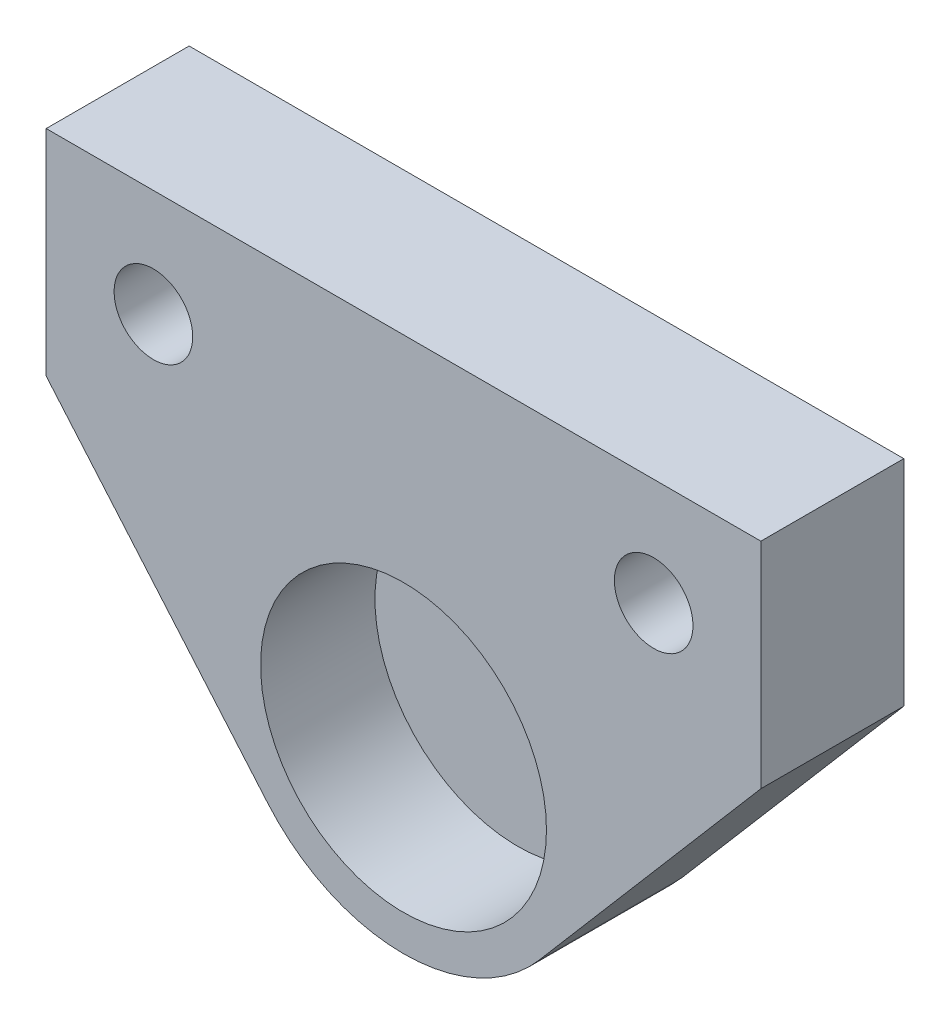
ISO-10303-21;
HEADER;
FILE_DESCRIPTION(('STEP AP214'),'2;1');
FILE_NAME('part.step','',(''),(''),'','','');
FILE_SCHEMA(('AUTOMOTIVE_DESIGN { 1 0 10303 214 1 1 1 1 }'));
ENDSEC;
DATA;
#1=APPLICATION_CONTEXT('core data for automotive mechanical design processes');
#2=APPLICATION_PROTOCOL_DEFINITION('international standard','automotive_design',2000,#1);
#3=PRODUCT_CONTEXT('',#1,'mechanical');
#4=PRODUCT('Part','Part','',(#3));
#5=PRODUCT_RELATED_PRODUCT_CATEGORY('part','',(#4));
#6=PRODUCT_DEFINITION_FORMATION('','',#4);
#7=PRODUCT_DEFINITION_CONTEXT('part definition',#1,'design');
#8=PRODUCT_DEFINITION('design','',#6,#7);
#9=PRODUCT_DEFINITION_SHAPE('','',#8);
#10=(LENGTH_UNIT() NAMED_UNIT(*) SI_UNIT(.MILLI.,.METRE.));
#11=(NAMED_UNIT(*) PLANE_ANGLE_UNIT() SI_UNIT($,.RADIAN.));
#12=(NAMED_UNIT(*) SI_UNIT($,.STERADIAN.) SOLID_ANGLE_UNIT());
#13=UNCERTAINTY_MEASURE_WITH_UNIT(LENGTH_MEASURE(1.E-05),#10,'distance_accuracy_value','');
#14=(GEOMETRIC_REPRESENTATION_CONTEXT(3) GLOBAL_UNCERTAINTY_ASSIGNED_CONTEXT((#13)) GLOBAL_UNIT_ASSIGNED_CONTEXT((#10,
#11,#12)) REPRESENTATION_CONTEXT('',''));
#15=CARTESIAN_POINT('',(0.,0.,0.));
#16=DIRECTION('',(0.,0.,1.));
#17=DIRECTION('',(1.,0.,0.));
#18=AXIS2_PLACEMENT_3D('',#15,#16,#17);
#19=CARTESIAN_POINT('',(0.,0.,0.));
#20=DIRECTION('',(0.,0.,1.));
#21=DIRECTION('',(1.,0.,0.));
#22=AXIS2_PLACEMENT_3D('',#19,#20,#21);
#23=PLANE('',#22);
#24=CARTESIAN_POINT('',(-17.5,17.4991007879726,0.));
#25=DIRECTION('',(0.,0.,-1.));
#26=DIRECTION('',(-1.,0.,0.));
#27=AXIS2_PLACEMENT_3D('',#24,#25,#26);
#28=CIRCLE('',#27,5.735);
#29=CARTESIAN_POINT('',(-23.235,17.4991007879726,0.));
#30=VERTEX_POINT('',#29);
#31=EDGE_CURVE('E201',#30,#30,#28,.T.);
#32=ORIENTED_EDGE('',*,*,#31,.F.);
#33=EDGE_LOOP('',(#32));
#34=FACE_BOUND('',#33,.T.);
#35=CARTESIAN_POINT('',(0.,0.,0.));
#36=DIRECTION('',(0.,0.,1.));
#37=DIRECTION('',(1.,0.,0.));
#38=AXIS2_PLACEMENT_3D('',#35,#36,#37);
#39=CIRCLE('',#38,12.5);
#40=CARTESIAN_POINT('',(-9.49973793714201,-8.12434484285502,0.));
#41=VERTEX_POINT('',#40);
#42=CARTESIAN_POINT('',(9.499737937142,-8.12434484285502,0.));
#43=VERTEX_POINT('',#42);
#44=EDGE_CURVE('E120',#41,#43,#39,.T.);
#45=ORIENTED_EDGE('',*,*,#44,.F.);
#46=DIRECTION('',(0.649947587428401,-0.759979034971361,0.));
#47=VECTOR('',#46,1.);
#48=CARTESIAN_POINT('',(-9.49973793714201,-8.12434484285502,0.));
#49=LINE('',#48,#47);
#50=CARTESIAN_POINT('',(-25.,10.,0.));
#51=VERTEX_POINT('',#50);
#52=EDGE_CURVE('E81',#51,#41,#49,.T.);
#53=ORIENTED_EDGE('',*,*,#52,.F.);
#54=DIRECTION('',(0.,-1.,0.));
#55=VECTOR('',#54,1.);
#56=CARTESIAN_POINT('',(-25.,10.,0.));
#57=LINE('',#56,#55);
#58=CARTESIAN_POINT('',(-25.,25.,0.));
#59=VERTEX_POINT('',#58);
#60=EDGE_CURVE('E75',#59,#51,#57,.T.);
#61=ORIENTED_EDGE('',*,*,#60,.F.);
#62=DIRECTION('',(-1.,0.,0.));
#63=VECTOR('',#62,1.);
#64=CARTESIAN_POINT('',(-25.,25.,0.));
#65=LINE('',#64,#63);
#66=CARTESIAN_POINT('',(25.,25.,0.));
#67=VERTEX_POINT('',#66);
#68=EDGE_CURVE('E110',#67,#59,#65,.T.);
#69=ORIENTED_EDGE('',*,*,#68,.F.);
#70=DIRECTION('',(0.,1.,0.));
#71=VECTOR('',#70,1.);
#72=CARTESIAN_POINT('',(25.,25.,0.));
#73=LINE('',#72,#71);
#74=CARTESIAN_POINT('',(25.,10.,0.));
#75=VERTEX_POINT('',#74);
#76=EDGE_CURVE('E126',#75,#67,#73,.T.);
#77=ORIENTED_EDGE('',*,*,#76,.F.);
#78=DIRECTION('',(0.649947587428401,0.759979034971361,0.));
#79=VECTOR('',#78,1.);
#80=CARTESIAN_POINT('',(25.,10.,0.));
#81=LINE('',#80,#79);
#82=EDGE_CURVE('E123',#43,#75,#81,.T.);
#83=ORIENTED_EDGE('',*,*,#82,.F.);
#84=EDGE_LOOP('',(#45,#53,#61,#69,#77,#83));
#85=FACE_BOUND('',#84,.T.);
#86=CARTESIAN_POINT('',(17.5,17.4991007879726,0.));
#87=DIRECTION('',(0.,0.,-1.));
#88=DIRECTION('',(-1.,0.,0.));
#89=AXIS2_PLACEMENT_3D('',#86,#87,#88);
#90=CIRCLE('',#89,5.735);
#91=CARTESIAN_POINT('',(11.765,17.4991007879726,0.));
#92=VERTEX_POINT('',#91);
#93=EDGE_CURVE('E194',#92,#92,#90,.T.);
#94=ORIENTED_EDGE('',*,*,#93,.F.);
#95=EDGE_LOOP('',(#94));
#96=FACE_BOUND('',#95,.T.);
#97=ADVANCED_FACE('F35',(#34,#85,#96),#23,.F.);
#98=CARTESIAN_POINT('',(0.,0.,10.));
#99=DIRECTION('',(0.,0.,-1.));
#100=DIRECTION('',(-1.,0.,0.));
#101=AXIS2_PLACEMENT_3D('',#98,#99,#100);
#102=CYLINDRICAL_SURFACE('',#101,12.5);
#103=ORIENTED_EDGE('',*,*,#44,.T.);
#104=DIRECTION('',(0.,0.,-1.));
#105=VECTOR('',#104,1.);
#106=CARTESIAN_POINT('',(9.499737937142,-8.12434484285502,10.));
#107=LINE('',#106,#105);
#108=CARTESIAN_POINT('',(9.499737937142,-8.12434484285502,10.));
#109=VERTEX_POINT('',#108);
#110=EDGE_CURVE('E11',#109,#43,#107,.T.);
#111=ORIENTED_EDGE('',*,*,#110,.F.);
#112=CARTESIAN_POINT('',(0.,0.,10.));
#113=DIRECTION('',(0.,0.,1.));
#114=DIRECTION('',(1.,0.,0.));
#115=AXIS2_PLACEMENT_3D('',#112,#113,#114);
#116=CIRCLE('',#115,12.5);
#117=CARTESIAN_POINT('',(-9.49973793714201,-8.12434484285502,10.));
#118=VERTEX_POINT('',#117);
#119=EDGE_CURVE('E131',#118,#109,#116,.T.);
#120=ORIENTED_EDGE('',*,*,#119,.F.);
#121=DIRECTION('',(0.,0.,-1.));
#122=VECTOR('',#121,1.);
#123=CARTESIAN_POINT('',(-9.49973793714201,-8.12434484285502,10.));
#124=LINE('',#123,#122);
#125=EDGE_CURVE('E116',#118,#41,#124,.T.);
#126=ORIENTED_EDGE('',*,*,#125,.T.);
#127=EDGE_LOOP('',(#103,#111,#120,#126));
#128=FACE_BOUND('',#127,.T.);
#129=ADVANCED_FACE('F37',(#128),#102,.T.);
#130=CARTESIAN_POINT('',(25.,10.,10.));
#131=DIRECTION('',(-0.759979034971361,0.649947587428401,0.));
#132=DIRECTION('',(-0.649947587428401,-0.759979034971361,0.));
#133=AXIS2_PLACEMENT_3D('',#130,#131,#132);
#134=PLANE('',#133);
#135=ORIENTED_EDGE('',*,*,#82,.T.);
#136=DIRECTION('',(0.,0.,-1.));
#137=VECTOR('',#136,1.);
#138=CARTESIAN_POINT('',(25.,10.,10.));
#139=LINE('',#138,#137);
#140=CARTESIAN_POINT('',(25.,10.,10.));
#141=VERTEX_POINT('',#140);
#142=EDGE_CURVE('E44',#141,#75,#139,.T.);
#143=ORIENTED_EDGE('',*,*,#142,.F.);
#144=DIRECTION('',(0.649947587428401,0.759979034971361,0.));
#145=VECTOR('',#144,1.);
#146=CARTESIAN_POINT('',(25.,10.,10.));
#147=LINE('',#146,#145);
#148=EDGE_CURVE('E89',#109,#141,#147,.T.);
#149=ORIENTED_EDGE('',*,*,#148,.F.);
#150=ORIENTED_EDGE('',*,*,#110,.T.);
#151=EDGE_LOOP('',(#135,#143,#149,#150));
#152=FACE_BOUND('',#151,.T.);
#153=ADVANCED_FACE('F161',(#152),#134,.F.);
#154=CARTESIAN_POINT('',(25.,25.,10.));
#155=DIRECTION('',(-1.,0.,0.));
#156=DIRECTION('',(0.,-1.,0.));
#157=AXIS2_PLACEMENT_3D('',#154,#155,#156);
#158=PLANE('',#157);
#159=ORIENTED_EDGE('',*,*,#76,.T.);
#160=DIRECTION('',(0.,0.,-1.));
#161=VECTOR('',#160,1.);
#162=CARTESIAN_POINT('',(25.,25.,10.));
#163=LINE('',#162,#161);
#164=CARTESIAN_POINT('',(25.,25.,10.));
#165=VERTEX_POINT('',#164);
#166=EDGE_CURVE('E111',#165,#67,#163,.T.);
#167=ORIENTED_EDGE('',*,*,#166,.F.);
#168=DIRECTION('',(0.,1.,0.));
#169=VECTOR('',#168,1.);
#170=CARTESIAN_POINT('',(25.,25.,10.));
#171=LINE('',#170,#169);
#172=EDGE_CURVE('E102',#141,#165,#171,.T.);
#173=ORIENTED_EDGE('',*,*,#172,.F.);
#174=ORIENTED_EDGE('',*,*,#142,.T.);
#175=EDGE_LOOP('',(#159,#167,#173,#174));
#176=FACE_BOUND('',#175,.T.);
#177=ADVANCED_FACE('F137',(#176),#158,.F.);
#178=CARTESIAN_POINT('',(-25.,25.,10.));
#179=DIRECTION('',(0.,-1.,0.));
#180=DIRECTION('',(0.,0.,-1.));
#181=AXIS2_PLACEMENT_3D('',#178,#179,#180);
#182=PLANE('',#181);
#183=ORIENTED_EDGE('',*,*,#68,.T.);
#184=DIRECTION('',(0.,0.,-1.));
#185=VECTOR('',#184,1.);
#186=CARTESIAN_POINT('',(-25.,25.,10.));
#187=LINE('',#186,#185);
#188=CARTESIAN_POINT('',(-25.,25.,10.));
#189=VERTEX_POINT('',#188);
#190=EDGE_CURVE('E107',#189,#59,#187,.T.);
#191=ORIENTED_EDGE('',*,*,#190,.F.);
#192=DIRECTION('',(-1.,0.,0.));
#193=VECTOR('',#192,1.);
#194=CARTESIAN_POINT('',(-25.,25.,10.));
#195=LINE('',#194,#193);
#196=EDGE_CURVE('E96',#165,#189,#195,.T.);
#197=ORIENTED_EDGE('',*,*,#196,.F.);
#198=ORIENTED_EDGE('',*,*,#166,.T.);
#199=EDGE_LOOP('',(#183,#191,#197,#198));
#200=FACE_BOUND('',#199,.T.);
#201=ADVANCED_FACE('F108',(#200),#182,.F.);
#202=CARTESIAN_POINT('',(-25.,10.,10.));
#203=DIRECTION('',(1.,0.,0.));
#204=DIRECTION('',(0.,0.,-1.));
#205=AXIS2_PLACEMENT_3D('',#202,#203,#204);
#206=PLANE('',#205);
#207=ORIENTED_EDGE('',*,*,#60,.T.);
#208=DIRECTION('',(0.,0.,-1.));
#209=VECTOR('',#208,1.);
#210=CARTESIAN_POINT('',(-25.,10.,10.));
#211=LINE('',#210,#209);
#212=CARTESIAN_POINT('',(-25.,10.,10.));
#213=VERTEX_POINT('',#212);
#214=EDGE_CURVE('E112',#213,#51,#211,.T.);
#215=ORIENTED_EDGE('',*,*,#214,.F.);
#216=DIRECTION('',(0.,-1.,0.));
#217=VECTOR('',#216,1.);
#218=CARTESIAN_POINT('',(-25.,10.,10.));
#219=LINE('',#218,#217);
#220=EDGE_CURVE('E100',#189,#213,#219,.T.);
#221=ORIENTED_EDGE('',*,*,#220,.F.);
#222=ORIENTED_EDGE('',*,*,#190,.T.);
#223=EDGE_LOOP('',(#207,#215,#221,#222));
#224=FACE_BOUND('',#223,.T.);
#225=ADVANCED_FACE('F114',(#224),#206,.F.);
#226=CARTESIAN_POINT('',(-9.49973793714201,-8.12434484285502,10.));
#227=DIRECTION('',(0.759979034971361,0.649947587428401,0.));
#228=DIRECTION('',(-0.649947587428401,0.759979034971361,0.));
#229=AXIS2_PLACEMENT_3D('',#226,#227,#228);
#230=PLANE('',#229);
#231=ORIENTED_EDGE('',*,*,#52,.T.);
#232=ORIENTED_EDGE('',*,*,#125,.F.);
#233=DIRECTION('',(0.649947587428401,-0.759979034971361,0.));
#234=VECTOR('',#233,1.);
#235=CARTESIAN_POINT('',(-9.49973793714201,-8.12434484285502,10.));
#236=LINE('',#235,#234);
#237=EDGE_CURVE('E52',#213,#118,#236,.T.);
#238=ORIENTED_EDGE('',*,*,#237,.F.);
#239=ORIENTED_EDGE('',*,*,#214,.T.);
#240=EDGE_LOOP('',(#231,#232,#238,#239));
#241=FACE_BOUND('',#240,.T.);
#242=ADVANCED_FACE('F144',(#241),#230,.F.);
#243=CARTESIAN_POINT('',(0.,0.,10.));
#244=DIRECTION('',(0.,0.,1.));
#245=DIRECTION('',(1.,0.,0.));
#246=AXIS2_PLACEMENT_3D('',#243,#244,#245);
#247=PLANE('',#246);
#248=CARTESIAN_POINT('',(17.5,17.4991007879726,10.));
#249=DIRECTION('',(0.,0.,1.));
#250=DIRECTION('',(1.,0.,0.));
#251=AXIS2_PLACEMENT_3D('',#248,#249,#250);
#252=CIRCLE('',#251,2.75);
#253=CARTESIAN_POINT('',(20.25,17.4991007879726,10.));
#254=VERTEX_POINT('',#253);
#255=EDGE_CURVE('E196',#254,#254,#252,.T.);
#256=ORIENTED_EDGE('',*,*,#255,.F.);
#257=EDGE_LOOP('',(#256));
#258=FACE_BOUND('',#257,.T.);
#259=CARTESIAN_POINT('',(-17.5,17.4991007879726,10.));
#260=DIRECTION('',(0.,0.,1.));
#261=DIRECTION('',(1.,0.,0.));
#262=AXIS2_PLACEMENT_3D('',#259,#260,#261);
#263=CIRCLE('',#262,2.75);
#264=CARTESIAN_POINT('',(-14.75,17.4991007879726,10.));
#265=VERTEX_POINT('',#264);
#266=EDGE_CURVE('E207',#265,#265,#263,.T.);
#267=ORIENTED_EDGE('',*,*,#266,.F.);
#268=EDGE_LOOP('',(#267));
#269=FACE_BOUND('',#268,.T.);
#270=CARTESIAN_POINT('',(0.,0.,10.));
#271=DIRECTION('',(0.,0.,1.));
#272=DIRECTION('',(1.,0.,0.));
#273=AXIS2_PLACEMENT_3D('',#270,#271,#272);
#274=CIRCLE('',#273,10.);
#275=CARTESIAN_POINT('',(10.,0.,10.));
#276=VERTEX_POINT('',#275);
#277=EDGE_CURVE('E210',#276,#276,#274,.T.);
#278=ORIENTED_EDGE('',*,*,#277,.F.);
#279=EDGE_LOOP('',(#278));
#280=FACE_BOUND('',#279,.T.);
#281=ORIENTED_EDGE('',*,*,#119,.T.);
#282=ORIENTED_EDGE('',*,*,#148,.T.);
#283=ORIENTED_EDGE('',*,*,#172,.T.);
#284=ORIENTED_EDGE('',*,*,#196,.T.);
#285=ORIENTED_EDGE('',*,*,#220,.T.);
#286=ORIENTED_EDGE('',*,*,#237,.T.);
#287=EDGE_LOOP('',(#281,#282,#283,#284,#285,#286));
#288=FACE_BOUND('',#287,.T.);
#289=ADVANCED_FACE('F98',(#258,#269,#280,#288),#247,.T.);
#290=CARTESIAN_POINT('',(0.,0.,2.));
#291=DIRECTION('',(0.,0.,1.));
#292=DIRECTION('',(1.,0.,0.));
#293=AXIS2_PLACEMENT_3D('',#290,#291,#292);
#294=CYLINDRICAL_SURFACE('',#293,10.);
#295=CARTESIAN_POINT('',(0.,0.,2.));
#296=DIRECTION('',(0.,0.,1.));
#297=DIRECTION('',(1.,0.,0.));
#298=AXIS2_PLACEMENT_3D('',#295,#296,#297);
#299=CIRCLE('',#298,10.);
#300=CARTESIAN_POINT('',(10.,0.,2.));
#301=VERTEX_POINT('',#300);
#302=EDGE_CURVE('E124',#301,#301,#299,.T.);
#303=ORIENTED_EDGE('',*,*,#302,.F.);
#304=EDGE_LOOP('',(#303));
#305=FACE_BOUND('',#304,.T.);
#306=ORIENTED_EDGE('',*,*,#277,.T.);
#307=EDGE_LOOP('',(#306));
#308=FACE_BOUND('',#307,.T.);
#309=ADVANCED_FACE('F151',(#305,#308),#294,.F.);
#310=CARTESIAN_POINT('',(0.,0.,2.));
#311=DIRECTION('',(0.,0.,1.));
#312=DIRECTION('',(1.,0.,0.));
#313=AXIS2_PLACEMENT_3D('',#310,#311,#312);
#314=PLANE('',#313);
#315=ORIENTED_EDGE('',*,*,#302,.T.);
#316=EDGE_LOOP('',(#315));
#317=FACE_BOUND('',#316,.T.);
#318=ADVANCED_FACE('F166',(#317),#314,.T.);
#319=CARTESIAN_POINT('',(-17.5,17.4991007879726,0.));
#320=DIRECTION('',(0.,0.,-1.));
#321=DIRECTION('',(-1.,0.,0.));
#322=AXIS2_PLACEMENT_3D('',#319,#320,#321);
#323=CYLINDRICAL_SURFACE('',#322,2.75);
#324=CARTESIAN_POINT('',(-17.5,17.4991007879726,2.985));
#325=DIRECTION('',(0.,0.,-1.));
#326=DIRECTION('',(-1.,0.,0.));
#327=AXIS2_PLACEMENT_3D('',#324,#325,#326);
#328=CIRCLE('',#327,2.75);
#329=CARTESIAN_POINT('',(-20.25,17.4991007879726,2.985));
#330=VERTEX_POINT('',#329);
#331=EDGE_CURVE('E204',#330,#330,#328,.T.);
#332=ORIENTED_EDGE('',*,*,#331,.T.);
#333=EDGE_LOOP('',(#332));
#334=FACE_BOUND('',#333,.T.);
#335=ORIENTED_EDGE('',*,*,#266,.T.);
#336=EDGE_LOOP('',(#335));
#337=FACE_BOUND('',#336,.T.);
#338=ADVANCED_FACE('F170',(#334,#337),#323,.F.);
#339=CARTESIAN_POINT('',(-17.5,17.4991007879726,0.));
#340=DIRECTION('',(0.,0.,-1.));
#341=DIRECTION('',(-1.,0.,0.));
#342=AXIS2_PLACEMENT_3D('',#339,#340,#341);
#343=CONICAL_SURFACE('',#342,5.735,0.785398163397449);
#344=ORIENTED_EDGE('',*,*,#331,.F.);
#345=EDGE_LOOP('',(#344));
#346=FACE_BOUND('',#345,.T.);
#347=ORIENTED_EDGE('',*,*,#31,.T.);
#348=EDGE_LOOP('',(#347));
#349=FACE_BOUND('',#348,.T.);
#350=ADVANCED_FACE('F174',(#346,#349),#343,.F.);
#351=CARTESIAN_POINT('',(17.5,17.4991007879726,0.));
#352=DIRECTION('',(0.,0.,-1.));
#353=DIRECTION('',(-1.,0.,0.));
#354=AXIS2_PLACEMENT_3D('',#351,#352,#353);
#355=CYLINDRICAL_SURFACE('',#354,2.75);
#356=CARTESIAN_POINT('',(17.5,17.4991007879726,2.985));
#357=DIRECTION('',(0.,0.,-1.));
#358=DIRECTION('',(-1.,0.,0.));
#359=AXIS2_PLACEMENT_3D('',#356,#357,#358);
#360=CIRCLE('',#359,2.75);
#361=CARTESIAN_POINT('',(14.75,17.4991007879726,2.985));
#362=VERTEX_POINT('',#361);
#363=EDGE_CURVE('E191',#362,#362,#360,.T.);
#364=ORIENTED_EDGE('',*,*,#363,.T.);
#365=EDGE_LOOP('',(#364));
#366=FACE_BOUND('',#365,.T.);
#367=ORIENTED_EDGE('',*,*,#255,.T.);
#368=EDGE_LOOP('',(#367));
#369=FACE_BOUND('',#368,.T.);
#370=ADVANCED_FACE('F178',(#366,#369),#355,.F.);
#371=CARTESIAN_POINT('',(17.5,17.4991007879726,0.));
#372=DIRECTION('',(0.,0.,-1.));
#373=DIRECTION('',(-1.,0.,0.));
#374=AXIS2_PLACEMENT_3D('',#371,#372,#373);
#375=CONICAL_SURFACE('',#374,5.735,0.785398163397449);
#376=ORIENTED_EDGE('',*,*,#363,.F.);
#377=EDGE_LOOP('',(#376));
#378=FACE_BOUND('',#377,.T.);
#379=ORIENTED_EDGE('',*,*,#93,.T.);
#380=EDGE_LOOP('',(#379));
#381=FACE_BOUND('',#380,.T.);
#382=ADVANCED_FACE('F182',(#378,#381),#375,.F.);
#383=CLOSED_SHELL('',(#97,#129,#153,#177,#201,#225,#242,#289,#309,#318,#338,#350,#370,#382));
#384=MANIFOLD_SOLID_BREP('B2',#383);
#385=ADVANCED_BREP_SHAPE_REPRESENTATION('',(#18,#384),#14);
#386=SHAPE_DEFINITION_REPRESENTATION(#9,#385);
ENDSEC;
END-ISO-10303-21;
